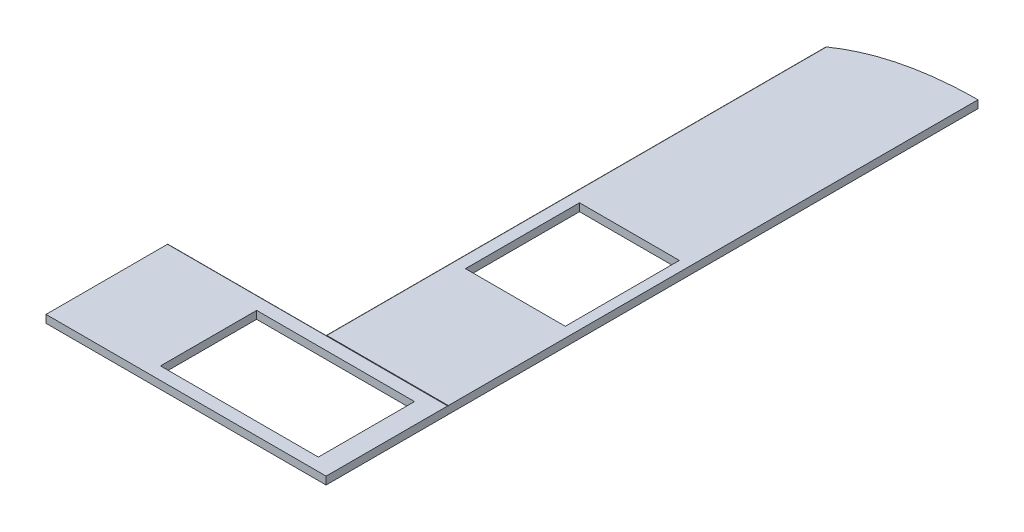
ISO-10303-21;
HEADER;
FILE_DESCRIPTION(('STEP AP214'),'2;1');
FILE_NAME('part.step','',(''),(''),'','','');
FILE_SCHEMA(('AUTOMOTIVE_DESIGN { 1 0 10303 214 1 1 1 1 }'));
ENDSEC;
DATA;
#1=APPLICATION_CONTEXT('core data for automotive mechanical design processes');
#2=APPLICATION_PROTOCOL_DEFINITION('international standard','automotive_design',2000,#1);
#3=PRODUCT_CONTEXT('',#1,'mechanical');
#4=PRODUCT('Part','Part','',(#3));
#5=PRODUCT_RELATED_PRODUCT_CATEGORY('part','',(#4));
#6=PRODUCT_DEFINITION_FORMATION('','',#4);
#7=PRODUCT_DEFINITION_CONTEXT('part definition',#1,'design');
#8=PRODUCT_DEFINITION('design','',#6,#7);
#9=PRODUCT_DEFINITION_SHAPE('','',#8);
#10=(LENGTH_UNIT() NAMED_UNIT(*) SI_UNIT(.MILLI.,.METRE.));
#11=(NAMED_UNIT(*) PLANE_ANGLE_UNIT() SI_UNIT($,.RADIAN.));
#12=(NAMED_UNIT(*) SI_UNIT($,.STERADIAN.) SOLID_ANGLE_UNIT());
#13=UNCERTAINTY_MEASURE_WITH_UNIT(LENGTH_MEASURE(1.E-05),#10,'distance_accuracy_value','');
#14=(GEOMETRIC_REPRESENTATION_CONTEXT(3) GLOBAL_UNCERTAINTY_ASSIGNED_CONTEXT((#13)) GLOBAL_UNIT_ASSIGNED_CONTEXT((#10,
#11,#12)) REPRESENTATION_CONTEXT('',''));
#15=CARTESIAN_POINT('',(0.,0.,0.));
#16=DIRECTION('',(0.,0.,1.));
#17=DIRECTION('',(1.,0.,0.));
#18=AXIS2_PLACEMENT_3D('',#15,#16,#17);
#19=CARTESIAN_POINT('',(1375.,-15.,-300.));
#20=DIRECTION('',(0.,0.,1.));
#21=DIRECTION('',(1.,0.,0.));
#22=AXIS2_PLACEMENT_3D('',#19,#20,#21);
#23=PLANE('',#22);
#24=DIRECTION('',(0.,1.,0.));
#25=VECTOR('',#24,1.);
#26=CARTESIAN_POINT('',(775.,15.,-300.));
#27=LINE('',#26,#25);
#28=CARTESIAN_POINT('',(775.,-15.,-300.));
#29=VERTEX_POINT('',#28);
#30=CARTESIAN_POINT('',(775.,15.,-300.));
#31=VERTEX_POINT('',#30);
#32=EDGE_CURVE('E259',#29,#31,#27,.T.);
#33=ORIENTED_EDGE('',*,*,#32,.F.);
#34=DIRECTION('',(-1.,0.,0.));
#35=VECTOR('',#34,1.);
#36=CARTESIAN_POINT('',(1375.,-15.,-300.));
#37=LINE('',#36,#35);
#38=CARTESIAN_POINT('',(0.,-15.,-300.));
#39=VERTEX_POINT('',#38);
#40=EDGE_CURVE('E237',#29,#39,#37,.T.);
#41=ORIENTED_EDGE('',*,*,#40,.T.);
#42=DIRECTION('',(0.,1.,0.));
#43=VECTOR('',#42,1.);
#44=CARTESIAN_POINT('',(0.,-15.,-300.));
#45=LINE('',#44,#43);
#46=CARTESIAN_POINT('',(0.,15.,-300.));
#47=VERTEX_POINT('',#46);
#48=EDGE_CURVE('E222',#39,#47,#45,.T.);
#49=ORIENTED_EDGE('',*,*,#48,.T.);
#50=DIRECTION('',(-1.,0.,0.));
#51=VECTOR('',#50,1.);
#52=CARTESIAN_POINT('',(1375.,15.,-300.));
#53=LINE('',#52,#51);
#54=EDGE_CURVE('E233',#31,#47,#53,.T.);
#55=ORIENTED_EDGE('',*,*,#54,.F.);
#56=EDGE_LOOP('',(#33,#41,#49,#55));
#57=FACE_BOUND('',#56,.T.);
#58=ADVANCED_FACE('F33',(#57),#23,.F.);
#59=CARTESIAN_POINT('',(1375.,-19.,300.));
#60=DIRECTION('',(0.,0.,-1.));
#61=DIRECTION('',(-1.,0.,0.));
#62=AXIS2_PLACEMENT_3D('',#59,#60,#61);
#63=PLANE('',#62);
#64=DIRECTION('',(0.,-1.,0.));
#65=VECTOR('',#64,1.);
#66=CARTESIAN_POINT('',(0.,-19.,300.));
#67=LINE('',#66,#65);
#68=CARTESIAN_POINT('',(0.,19.,300.));
#69=VERTEX_POINT('',#68);
#70=CARTESIAN_POINT('',(0.,-19.,300.));
#71=VERTEX_POINT('',#70);
#72=EDGE_CURVE('E197',#69,#71,#67,.T.);
#73=ORIENTED_EDGE('',*,*,#72,.T.);
#74=DIRECTION('',(-1.,0.,0.));
#75=VECTOR('',#74,1.);
#76=CARTESIAN_POINT('',(1375.,-19.,300.));
#77=LINE('',#76,#75);
#78=CARTESIAN_POINT('',(1375.,-19.,300.));
#79=VERTEX_POINT('',#78);
#80=EDGE_CURVE('E11',#79,#71,#77,.T.);
#81=ORIENTED_EDGE('',*,*,#80,.F.);
#82=DIRECTION('',(0.,-1.,0.));
#83=VECTOR('',#82,1.);
#84=CARTESIAN_POINT('',(1375.,-19.,300.));
#85=LINE('',#84,#83);
#86=CARTESIAN_POINT('',(1375.,19.,300.));
#87=VERTEX_POINT('',#86);
#88=EDGE_CURVE('E206',#87,#79,#85,.T.);
#89=ORIENTED_EDGE('',*,*,#88,.F.);
#90=DIRECTION('',(-1.,0.,0.));
#91=VECTOR('',#90,1.);
#92=CARTESIAN_POINT('',(1375.,19.,300.));
#93=LINE('',#92,#91);
#94=EDGE_CURVE('E216',#87,#69,#93,.T.);
#95=ORIENTED_EDGE('',*,*,#94,.T.);
#96=EDGE_LOOP('',(#73,#81,#89,#95));
#97=FACE_BOUND('',#96,.T.);
#98=ADVANCED_FACE('F35',(#97),#63,.F.);
#99=CARTESIAN_POINT('',(1375.,-19.,-296.));
#100=DIRECTION('',(0.,1.,0.));
#101=DIRECTION('',(0.,0.,1.));
#102=AXIS2_PLACEMENT_3D('',#99,#100,#101);
#103=PLANE('',#102);
#104=DIRECTION('',(1.,0.,0.));
#105=VECTOR('',#104,1.);
#106=CARTESIAN_POINT('',(1275.,-19.0000000000004,238.));
#107=LINE('',#106,#105);
#108=CARTESIAN_POINT('',(500.,-19.0000000000004,238.));
#109=VERTEX_POINT('',#108);
#110=CARTESIAN_POINT('',(1275.,-19.0000000000004,238.));
#111=VERTEX_POINT('',#110);
#112=EDGE_CURVE('E383',#109,#111,#107,.T.);
#113=ORIENTED_EDGE('',*,*,#112,.T.);
#114=DIRECTION('',(0.,0.,-1.));
#115=VECTOR('',#114,1.);
#116=CARTESIAN_POINT('',(1275.,-19.0000000000004,-234.));
#117=LINE('',#116,#115);
#118=CARTESIAN_POINT('',(1275.,-19.0000000000004,-234.));
#119=VERTEX_POINT('',#118);
#120=EDGE_CURVE('E410',#111,#119,#117,.T.);
#121=ORIENTED_EDGE('',*,*,#120,.T.);
#122=DIRECTION('',(-1.,0.,0.));
#123=VECTOR('',#122,1.);
#124=CARTESIAN_POINT('',(1275.,-19.0000000000004,-234.));
#125=LINE('',#124,#123);
#126=CARTESIAN_POINT('',(500.,-19.,-234.));
#127=VERTEX_POINT('',#126);
#128=EDGE_CURVE('E423',#119,#127,#125,.T.);
#129=ORIENTED_EDGE('',*,*,#128,.T.);
#130=DIRECTION('',(0.,0.,1.));
#131=VECTOR('',#130,1.);
#132=CARTESIAN_POINT('',(500.,-19.0000000000004,-234.));
#133=LINE('',#132,#131);
#134=EDGE_CURVE('E421',#127,#109,#133,.T.);
#135=ORIENTED_EDGE('',*,*,#134,.T.);
#136=EDGE_LOOP('',(#113,#121,#129,#135));
#137=FACE_BOUND('',#136,.T.);
#138=DIRECTION('',(0.,0.,-1.));
#139=VECTOR('',#138,1.);
#140=CARTESIAN_POINT('',(0.,-19.,-296.));
#141=LINE('',#140,#139);
#142=CARTESIAN_POINT('',(0.,-19.,-296.));
#143=VERTEX_POINT('',#142);
#144=EDGE_CURVE('E200',#71,#143,#141,.T.);
#145=ORIENTED_EDGE('',*,*,#144,.T.);
#146=DIRECTION('',(-1.,0.,0.));
#147=VECTOR('',#146,1.);
#148=CARTESIAN_POINT('',(1375.,-19.,-296.));
#149=LINE('',#148,#147);
#150=CARTESIAN_POINT('',(1375.,-19.,-296.));
#151=VERTEX_POINT('',#150);
#152=EDGE_CURVE('E41',#151,#143,#149,.T.);
#153=ORIENTED_EDGE('',*,*,#152,.F.);
#154=DIRECTION('',(0.,0.,-1.));
#155=VECTOR('',#154,1.);
#156=CARTESIAN_POINT('',(1375.,-19.,-296.));
#157=LINE('',#156,#155);
#158=EDGE_CURVE('E208',#79,#151,#157,.T.);
#159=ORIENTED_EDGE('',*,*,#158,.F.);
#160=ORIENTED_EDGE('',*,*,#80,.T.);
#161=EDGE_LOOP('',(#145,#153,#159,#160));
#162=FACE_BOUND('',#161,.T.);
#163=ADVANCED_FACE('F368',(#137,#162),#103,.F.);
#164=CARTESIAN_POINT('',(1375.,-15.,-296.));
#165=DIRECTION('',(-1.,0.,0.));
#166=DIRECTION('',(0.,0.,1.));
#167=AXIS2_PLACEMENT_3D('',#164,#165,#166);
#168=CYLINDRICAL_SURFACE('',#167,4.);
#169=CARTESIAN_POINT('',(0.,-15.,-296.));
#170=DIRECTION('',(1.,0.,0.));
#171=DIRECTION('',(0.,0.,-1.));
#172=AXIS2_PLACEMENT_3D('',#169,#170,#171);
#173=CIRCLE('',#172,4.);
#174=EDGE_CURVE('E219',#143,#39,#173,.T.);
#175=ORIENTED_EDGE('',*,*,#174,.T.);
#176=ORIENTED_EDGE('',*,*,#40,.F.);
#177=CARTESIAN_POINT('',(1375.,-15.,-300.));
#178=VERTEX_POINT('',#177);
#179=EDGE_CURVE('E238',#178,#29,#37,.T.);
#180=ORIENTED_EDGE('',*,*,#179,.F.);
#181=CARTESIAN_POINT('',(1375.,-15.,-296.));
#182=DIRECTION('',(1.,0.,0.));
#183=DIRECTION('',(0.,0.,-1.));
#184=AXIS2_PLACEMENT_3D('',#181,#182,#183);
#185=CIRCLE('',#184,4.);
#186=EDGE_CURVE('E211',#151,#178,#185,.T.);
#187=ORIENTED_EDGE('',*,*,#186,.F.);
#188=ORIENTED_EDGE('',*,*,#152,.T.);
#189=EDGE_LOOP('',(#175,#176,#180,#187,#188));
#190=FACE_BOUND('',#189,.T.);
#191=ADVANCED_FACE('F245',(#190),#168,.T.);
#192=CARTESIAN_POINT('',(1375.,15.,-296.));
#193=DIRECTION('',(-1.,0.,0.));
#194=DIRECTION('',(0.,0.,1.));
#195=AXIS2_PLACEMENT_3D('',#192,#193,#194);
#196=CYLINDRICAL_SURFACE('',#195,4.);
#197=CARTESIAN_POINT('',(0.,15.,-296.));
#198=DIRECTION('',(1.,0.,0.));
#199=DIRECTION('',(0.,0.,-1.));
#200=AXIS2_PLACEMENT_3D('',#197,#198,#199);
#201=CIRCLE('',#200,4.);
#202=CARTESIAN_POINT('',(0.,19.,-296.));
#203=VERTEX_POINT('',#202);
#204=EDGE_CURVE('E225',#47,#203,#201,.T.);
#205=ORIENTED_EDGE('',*,*,#204,.T.);
#206=DIRECTION('',(-1.,0.,0.));
#207=VECTOR('',#206,1.);
#208=CARTESIAN_POINT('',(1375.,19.,-296.));
#209=LINE('',#208,#207);
#210=CARTESIAN_POINT('',(1375.,19.,-296.));
#211=VERTEX_POINT('',#210);
#212=EDGE_CURVE('E230',#211,#203,#209,.T.);
#213=ORIENTED_EDGE('',*,*,#212,.F.);
#214=CARTESIAN_POINT('',(1375.,15.,-296.));
#215=DIRECTION('',(1.,0.,0.));
#216=DIRECTION('',(0.,0.,-1.));
#217=AXIS2_PLACEMENT_3D('',#214,#215,#216);
#218=CIRCLE('',#217,4.);
#219=CARTESIAN_POINT('',(1375.,15.,-300.));
#220=VERTEX_POINT('',#219);
#221=EDGE_CURVE('E213',#220,#211,#218,.T.);
#222=ORIENTED_EDGE('',*,*,#221,.F.);
#223=EDGE_CURVE('E234',#220,#31,#53,.T.);
#224=ORIENTED_EDGE('',*,*,#223,.T.);
#225=ORIENTED_EDGE('',*,*,#54,.T.);
#226=EDGE_LOOP('',(#205,#213,#222,#224,#225));
#227=FACE_BOUND('',#226,.T.);
#228=ADVANCED_FACE('F372',(#227),#196,.T.);
#229=CARTESIAN_POINT('',(1375.,19.,-296.));
#230=DIRECTION('',(0.,-1.,0.));
#231=DIRECTION('',(0.,0.,-1.));
#232=AXIS2_PLACEMENT_3D('',#229,#230,#231);
#233=PLANE('',#232);
#234=DIRECTION('',(-1.,0.,0.));
#235=VECTOR('',#234,1.);
#236=CARTESIAN_POINT('',(1275.,19.,-234.));
#237=LINE('',#236,#235);
#238=CARTESIAN_POINT('',(1275.,19.,-234.));
#239=VERTEX_POINT('',#238);
#240=CARTESIAN_POINT('',(500.,19.,-234.));
#241=VERTEX_POINT('',#240);
#242=EDGE_CURVE('E414',#239,#241,#237,.T.);
#243=ORIENTED_EDGE('',*,*,#242,.F.);
#244=DIRECTION('',(0.,0.,-1.));
#245=VECTOR('',#244,1.);
#246=CARTESIAN_POINT('',(1275.,19.,-234.));
#247=LINE('',#246,#245);
#248=CARTESIAN_POINT('',(1275.,19.,238.));
#249=VERTEX_POINT('',#248);
#250=EDGE_CURVE('E417',#249,#239,#247,.T.);
#251=ORIENTED_EDGE('',*,*,#250,.F.);
#252=DIRECTION('',(1.,0.,0.));
#253=VECTOR('',#252,1.);
#254=CARTESIAN_POINT('',(1275.,19.,238.));
#255=LINE('',#254,#253);
#256=CARTESIAN_POINT('',(500.,19.,238.));
#257=VERTEX_POINT('',#256);
#258=EDGE_CURVE('E407',#257,#249,#255,.T.);
#259=ORIENTED_EDGE('',*,*,#258,.F.);
#260=DIRECTION('',(0.,0.,1.));
#261=VECTOR('',#260,1.);
#262=CARTESIAN_POINT('',(500.,19.,-234.));
#263=LINE('',#262,#261);
#264=EDGE_CURVE('E411',#241,#257,#263,.T.);
#265=ORIENTED_EDGE('',*,*,#264,.F.);
#266=EDGE_LOOP('',(#243,#251,#259,#265));
#267=FACE_BOUND('',#266,.T.);
#268=DIRECTION('',(0.,0.,1.));
#269=VECTOR('',#268,1.);
#270=CARTESIAN_POINT('',(0.,19.,-296.));
#271=LINE('',#270,#269);
#272=EDGE_CURVE('E209',#203,#69,#271,.T.);
#273=ORIENTED_EDGE('',*,*,#272,.T.);
#274=ORIENTED_EDGE('',*,*,#94,.F.);
#275=DIRECTION('',(0.,0.,1.));
#276=VECTOR('',#275,1.);
#277=CARTESIAN_POINT('',(1375.,19.,-296.));
#278=LINE('',#277,#276);
#279=EDGE_CURVE('E215',#211,#87,#278,.T.);
#280=ORIENTED_EDGE('',*,*,#279,.F.);
#281=ORIENTED_EDGE('',*,*,#212,.T.);
#282=EDGE_LOOP('',(#273,#274,#280,#281));
#283=FACE_BOUND('',#282,.T.);
#284=ADVANCED_FACE('F388',(#267,#283),#233,.F.);
#285=CARTESIAN_POINT('',(1375.,15.,-296.));
#286=DIRECTION('',(1.,0.,0.));
#287=DIRECTION('',(0.,0.,-1.));
#288=AXIS2_PLACEMENT_3D('',#285,#286,#287);
#289=PLANE('',#288);
#290=ORIENTED_EDGE('',*,*,#88,.T.);
#291=ORIENTED_EDGE('',*,*,#158,.T.);
#292=ORIENTED_EDGE('',*,*,#186,.T.);
#293=DIRECTION('',(0.,-1.,0.));
#294=VECTOR('',#293,1.);
#295=CARTESIAN_POINT('',(1375.,19.,-300.));
#296=LINE('',#295,#294);
#297=CARTESIAN_POINT('',(1375.,-19.,-300.));
#298=VERTEX_POINT('',#297);
#299=EDGE_CURVE('E195',#178,#298,#296,.T.);
#300=ORIENTED_EDGE('',*,*,#299,.T.);
#301=DIRECTION('',(0.,0.,1.));
#302=VECTOR('',#301,1.);
#303=CARTESIAN_POINT('',(1375.,-19.,-2900.));
#304=LINE('',#303,#302);
#305=CARTESIAN_POINT('',(1375.,-19.0000000000004,-2900.));
#306=VERTEX_POINT('',#305);
#307=EDGE_CURVE('E188',#306,#298,#304,.T.);
#308=ORIENTED_EDGE('',*,*,#307,.F.);
#309=DIRECTION('',(0.,-1.,0.));
#310=VECTOR('',#309,1.);
#311=CARTESIAN_POINT('',(1375.,19.,-2900.));
#312=LINE('',#311,#310);
#313=CARTESIAN_POINT('',(1375.,19.,-2900.));
#314=VERTEX_POINT('',#313);
#315=EDGE_CURVE('E169',#314,#306,#312,.T.);
#316=ORIENTED_EDGE('',*,*,#315,.F.);
#317=DIRECTION('',(0.,0.,1.));
#318=VECTOR('',#317,1.);
#319=CARTESIAN_POINT('',(1375.,19.,-2900.));
#320=LINE('',#319,#318);
#321=CARTESIAN_POINT('',(1375.,19.,-300.));
#322=VERTEX_POINT('',#321);
#323=EDGE_CURVE('E180',#314,#322,#320,.T.);
#324=ORIENTED_EDGE('',*,*,#323,.T.);
#325=EDGE_CURVE('E272',#322,#220,#296,.T.);
#326=ORIENTED_EDGE('',*,*,#325,.T.);
#327=ORIENTED_EDGE('',*,*,#221,.T.);
#328=ORIENTED_EDGE('',*,*,#279,.T.);
#329=EDGE_LOOP('',(#290,#291,#292,#300,#308,#316,#324,#326,#327,#328));
#330=FACE_BOUND('',#329,.T.);
#331=ADVANCED_FACE('F193',(#330),#289,.T.);
#332=CARTESIAN_POINT('',(0.,15.,-296.));
#333=DIRECTION('',(1.,0.,0.));
#334=DIRECTION('',(0.,0.,-1.));
#335=AXIS2_PLACEMENT_3D('',#332,#333,#334);
#336=PLANE('',#335);
#337=ORIENTED_EDGE('',*,*,#72,.F.);
#338=ORIENTED_EDGE('',*,*,#272,.F.);
#339=ORIENTED_EDGE('',*,*,#204,.F.);
#340=ORIENTED_EDGE('',*,*,#48,.F.);
#341=ORIENTED_EDGE('',*,*,#174,.F.);
#342=ORIENTED_EDGE('',*,*,#144,.F.);
#343=EDGE_LOOP('',(#337,#338,#339,#340,#341,#342));
#344=FACE_BOUND('',#343,.T.);
#345=ADVANCED_FACE('F252',(#344),#336,.F.);
#346=CARTESIAN_POINT('',(779.,-15.,-300.));
#347=DIRECTION('',(0.,0.,-1.));
#348=DIRECTION('',(-1.,0.,0.));
#349=AXIS2_PLACEMENT_3D('',#346,#347,#348);
#350=PLANE('',#349);
#351=ORIENTED_EDGE('',*,*,#299,.F.);
#352=ORIENTED_EDGE('',*,*,#179,.T.);
#353=CARTESIAN_POINT('',(779.,-15.,-300.));
#354=DIRECTION('',(0.,0.,-1.));
#355=DIRECTION('',(-1.,0.,0.));
#356=AXIS2_PLACEMENT_3D('',#353,#354,#355);
#357=CIRCLE('',#356,4.);
#358=CARTESIAN_POINT('',(779.,-19.,-300.));
#359=VERTEX_POINT('',#358);
#360=EDGE_CURVE('E264',#359,#29,#357,.T.);
#361=ORIENTED_EDGE('',*,*,#360,.F.);
#362=DIRECTION('',(-1.,0.,0.));
#363=VECTOR('',#362,1.);
#364=CARTESIAN_POINT('',(1375.,-19.,-300.));
#365=LINE('',#364,#363);
#366=EDGE_CURVE('E268',#298,#359,#365,.T.);
#367=ORIENTED_EDGE('',*,*,#366,.F.);
#368=EDGE_LOOP('',(#351,#352,#361,#367));
#369=FACE_BOUND('',#368,.T.);
#370=ADVANCED_FACE('F263',(#369),#350,.F.);
#371=CARTESIAN_POINT('',(1375.,-19.,-2900.));
#372=DIRECTION('',(0.,1.,0.));
#373=DIRECTION('',(0.,0.,1.));
#374=AXIS2_PLACEMENT_3D('',#371,#372,#373);
#375=PLANE('',#374);
#376=DIRECTION('',(1.,0.,0.));
#377=VECTOR('',#376,1.);
#378=CARTESIAN_POINT('',(835.,-19.0000000000004,-924.));
#379=LINE('',#378,#377);
#380=CARTESIAN_POINT('',(835.,-19.0000000000004,-924.));
#381=VERTEX_POINT('',#380);
#382=CARTESIAN_POINT('',(1325.,-19.0000000000004,-924.));
#383=VERTEX_POINT('',#382);
#384=EDGE_CURVE('E430',#381,#383,#379,.T.);
#385=ORIENTED_EDGE('',*,*,#384,.T.);
#386=DIRECTION('',(0.,0.,-1.));
#387=VECTOR('',#386,1.);
#388=CARTESIAN_POINT('',(1325.,-19.0000000000004,-924.));
#389=LINE('',#388,#387);
#390=CARTESIAN_POINT('',(1325.,-19.0000000000004,-1484.));
#391=VERTEX_POINT('',#390);
#392=EDGE_CURVE('E438',#383,#391,#389,.T.);
#393=ORIENTED_EDGE('',*,*,#392,.T.);
#394=DIRECTION('',(-1.,0.,0.));
#395=VECTOR('',#394,1.);
#396=CARTESIAN_POINT('',(835.,-19.0000000000004,-1484.));
#397=LINE('',#396,#395);
#398=CARTESIAN_POINT('',(835.,-19.,-1484.));
#399=VERTEX_POINT('',#398);
#400=EDGE_CURVE('E449',#391,#399,#397,.T.);
#401=ORIENTED_EDGE('',*,*,#400,.T.);
#402=DIRECTION('',(0.,0.,1.));
#403=VECTOR('',#402,1.);
#404=CARTESIAN_POINT('',(835.,-19.0000000000004,-924.));
#405=LINE('',#404,#403);
#406=EDGE_CURVE('E48',#399,#381,#405,.T.);
#407=ORIENTED_EDGE('',*,*,#406,.T.);
#408=EDGE_LOOP('',(#385,#393,#401,#407));
#409=FACE_BOUND('',#408,.T.);
#410=DIRECTION('',(0.,0.,1.));
#411=VECTOR('',#410,1.);
#412=CARTESIAN_POINT('',(779.,-19.,-2900.));
#413=LINE('',#412,#411);
#414=CARTESIAN_POINT('',(779.000000000003,-19.0000000000004,-2752.82345211521));
#415=VERTEX_POINT('',#414);
#416=EDGE_CURVE('E189',#415,#359,#413,.T.);
#417=ORIENTED_EDGE('',*,*,#416,.F.);
#418=CARTESIAN_POINT('',(775.,-19.0000000000004,-2750.));
#419=CARTESIAN_POINT('',(983.393090416953,-19.0000000000004,-2898.41660785058));
#420=CARTESIAN_POINT('',(1375.,-19.0000000000004,-2900.));
#421=B_SPLINE_CURVE_WITH_KNOTS('',2,(#418,#419,#420),.UNSPECIFIED.,.F.,.F.,(3,3),(0.,1.),.UNSPECIFIED.);
#422=EDGE_CURVE('E172',#415,#306,#421,.T.);
#423=ORIENTED_EDGE('',*,*,#422,.T.);
#424=ORIENTED_EDGE('',*,*,#307,.T.);
#425=ORIENTED_EDGE('',*,*,#366,.T.);
#426=EDGE_LOOP('',(#417,#423,#424,#425));
#427=FACE_BOUND('',#426,.T.);
#428=ADVANCED_FACE('F186',(#409,#427),#375,.F.);
#429=CARTESIAN_POINT('',(779.,-15.,-2900.));
#430=DIRECTION('',(0.,0.,1.));
#431=DIRECTION('',(1.,0.,0.));
#432=AXIS2_PLACEMENT_3D('',#429,#430,#431);
#433=CYLINDRICAL_SURFACE('',#432,4.);
#434=DIRECTION('',(0.,0.,1.));
#435=VECTOR('',#434,1.);
#436=CARTESIAN_POINT('',(775.,-15.,-2900.));
#437=LINE('',#436,#435);
#438=CARTESIAN_POINT('',(775.,-15.,-2750.));
#439=VERTEX_POINT('',#438);
#440=EDGE_CURVE('E202',#439,#29,#437,.T.);
#441=ORIENTED_EDGE('',*,*,#440,.F.);
#442=CARTESIAN_POINT('',(775.,-15.,-2750.));
#443=CARTESIAN_POINT('',(774.999979877533,-15.0977896592813,-2749.99998541423));
#444=CARTESIAN_POINT('',(775.003585156807,-15.195569471886,-2750.00255332583));
#445=CARTESIAN_POINT('',(775.017896300316,-15.3902990314293,-2750.01274530157));
#446=CARTESIAN_POINT('',(775.02859889183,-15.4872491401005,-2750.02036703528));
#447=CARTESIAN_POINT('',(775.056876381708,-15.6790692156135,-2750.04050223327));
#448=CARTESIAN_POINT('',(775.074412993558,-15.7739477143784,-2750.05298844498));
#449=CARTESIAN_POINT('',(775.116090152642,-15.9614942726811,-2750.08265806367));
#450=CARTESIAN_POINT('',(775.140231161588,-16.0541621771843,-2750.09984179905));
#451=CARTESIAN_POINT('',(775.194731542074,-16.2365152946048,-2750.13862758149));
#452=CARTESIAN_POINT('',(775.225079900518,-16.3262054674816,-2750.16022180335));
#453=CARTESIAN_POINT('',(775.29162489079,-16.5022734221981,-2750.20755999604));
#454=CARTESIAN_POINT('',(775.327823776836,-16.5886499113329,-2750.23330556637));
#455=CARTESIAN_POINT('',(775.444621450742,-16.8422483833437,-2750.31635171929));
#456=CARTESIAN_POINT('',(775.533410130503,-17.0039028600607,-2750.37945382298));
#457=CARTESIAN_POINT('',(775.735715190371,-17.3199247395958,-2750.5231275179));
#458=CARTESIAN_POINT('',(775.850497475558,-17.4730606869436,-2750.604591724));
#459=CARTESIAN_POINT('',(776.096594113057,-17.757837875557,-2750.77909804911));
#460=CARTESIAN_POINT('',(776.227912563648,-17.8894737696639,-2750.87214303822));
#461=CARTESIAN_POINT('',(776.52787378822,-18.1519890554947,-2751.08447149695));
#462=CARTESIAN_POINT('',(776.699009580176,-18.2786140868253,-2751.20548467458));
#463=CARTESIAN_POINT('',(777.054323116433,-18.5011954192325,-2751.45642116752));
#464=CARTESIAN_POINT('',(777.238515123026,-18.5971175303592,-2751.58635422165));
#465=CARTESIAN_POINT('',(777.650306357432,-18.7732271531907,-2751.87646296954));
#466=CARTESIAN_POINT('',(777.87967916704,-18.8473196510077,-2752.03782063237));
#467=CARTESIAN_POINT('',(778.344781885959,-18.9531586444466,-2752.36448749494));
#468=CARTESIAN_POINT('',(778.580502015225,-18.9849668657346,-2752.52979057535));
#469=CARTESIAN_POINT('',(778.877824517024,-18.9986008506908,-2752.73796288557));
#470=CARTESIAN_POINT('',(778.938918163252,-18.9999999448956,-2752.78072050217));
#471=CARTESIAN_POINT('',(779.,-19.,-2752.82345211521));
#472=B_SPLINE_CURVE_WITH_KNOTS('',3,(#442,#443,#444,#445,#446,#447,#448,#449,#450,#451,#452,
#453,#454,#455,#456,#457,#458,#459,#460,#461,#462,#463,#464,#465,#466,#467,#468,#469,#470,#471),
.UNSPECIFIED.,.F.,.F.,(4,2,2,2,2,2,2,2,2,2,2,2,2,2,4),(0.,0.293253389905308,0.586371648415019,
0.87787083461123,1.16939040463113,1.46039717779363,1.75151634484239,2.33387028452236,
2.95559389054226,3.57747188730174,4.30937551036755,5.04209134886918,5.90894096908045,
6.77452378643034,6.99821345336306),.UNSPECIFIED.);
#473=EDGE_CURVE('E291',#439,#415,#472,.T.);
#474=ORIENTED_EDGE('',*,*,#473,.T.);
#475=ORIENTED_EDGE('',*,*,#416,.T.);
#476=ORIENTED_EDGE('',*,*,#360,.T.);
#477=EDGE_LOOP('',(#441,#474,#475,#476));
#478=FACE_BOUND('',#477,.T.);
#479=ADVANCED_FACE('F267',(#478),#433,.T.);
#480=CARTESIAN_POINT('',(775.,15.,-2900.));
#481=DIRECTION('',(1.,0.,0.));
#482=DIRECTION('',(0.,0.,-1.));
#483=AXIS2_PLACEMENT_3D('',#480,#481,#482);
#484=PLANE('',#483);
#485=DIRECTION('',(0.,0.,1.));
#486=VECTOR('',#485,1.);
#487=CARTESIAN_POINT('',(775.,15.,-2900.));
#488=LINE('',#487,#486);
#489=CARTESIAN_POINT('',(775.,15.,-2750.));
#490=VERTEX_POINT('',#489);
#491=EDGE_CURVE('E282',#490,#31,#488,.T.);
#492=ORIENTED_EDGE('',*,*,#491,.F.);
#493=DIRECTION('',(0.,1.,0.));
#494=VECTOR('',#493,1.);
#495=CARTESIAN_POINT('',(775.,-19.0000000000004,-2750.));
#496=LINE('',#495,#494);
#497=EDGE_CURVE('E190',#439,#490,#496,.T.);
#498=ORIENTED_EDGE('',*,*,#497,.F.);
#499=ORIENTED_EDGE('',*,*,#440,.T.);
#500=ORIENTED_EDGE('',*,*,#32,.T.);
#501=EDGE_LOOP('',(#492,#498,#499,#500));
#502=FACE_BOUND('',#501,.T.);
#503=ADVANCED_FACE('F286',(#502),#484,.F.);
#504=CARTESIAN_POINT('',(779.,15.,-2900.));
#505=DIRECTION('',(0.,0.,1.));
#506=DIRECTION('',(1.,0.,0.));
#507=AXIS2_PLACEMENT_3D('',#504,#505,#506);
#508=CYLINDRICAL_SURFACE('',#507,4.);
#509=DIRECTION('',(0.,0.,1.));
#510=VECTOR('',#509,1.);
#511=CARTESIAN_POINT('',(779.,19.,-2900.));
#512=LINE('',#511,#510);
#513=CARTESIAN_POINT('',(779.000000000004,19.,-2752.82345211521));
#514=VERTEX_POINT('',#513);
#515=CARTESIAN_POINT('',(779.,19.,-300.));
#516=VERTEX_POINT('',#515);
#517=EDGE_CURVE('E280',#514,#516,#512,.T.);
#518=ORIENTED_EDGE('',*,*,#517,.F.);
#519=CARTESIAN_POINT('',(779.,19.,-2752.82345211521));
#520=CARTESIAN_POINT('',(778.861386894271,18.9999913473369,-2752.72648163509));
#521=CARTESIAN_POINT('',(778.722808137929,18.9927941827911,-2752.62944358639));
#522=CARTESIAN_POINT('',(778.446670579474,18.9639786822407,-2752.435904357));
#523=CARTESIAN_POINT('',(778.309112363553,18.9423526224835,-2752.33940349177));
#524=CARTESIAN_POINT('',(778.034768005762,18.8843497202456,-2752.14676826633));
#525=CARTESIAN_POINT('',(777.898002951841,18.8478291189761,-2752.05064696804));
#526=CARTESIAN_POINT('',(777.627795457625,18.759951535708,-2751.86056938362));
#527=CARTESIAN_POINT('',(777.494352409423,18.7085972901794,-2751.76661270163));
#528=CARTESIAN_POINT('',(777.236765685375,18.5930763812076,-2751.58508978684));
#529=CARTESIAN_POINT('',(777.112460261187,18.5294417122522,-2751.49741536678));
#530=CARTESIAN_POINT('',(776.869333430933,18.388218157036,-2751.32579734201));
#531=CARTESIAN_POINT('',(776.750511001145,18.3106318890101,-2751.24185304097));
#532=CARTESIAN_POINT('',(776.520226425103,18.1418153991001,-2751.07904146552));
#533=CARTESIAN_POINT('',(776.408734859598,18.0506452064179,-2751.00015393466));
#534=CARTESIAN_POINT('',(776.194241148692,17.8546178705334,-2750.84828019699));
#535=CARTESIAN_POINT('',(776.09123444239,17.7497681598994,-2750.77529082013));
#536=CARTESIAN_POINT('',(775.862168898731,17.4886612433585,-2750.61287541276));
#537=CARTESIAN_POINT('',(775.740104200797,17.3270142297119,-2750.52624500905));
#538=CARTESIAN_POINT('',(775.574478445123,17.0679366308166,-2750.40861960674));
#539=CARTESIAN_POINT('',(775.52215375828,16.9787469495488,-2750.37144459534));
#540=CARTESIAN_POINT('',(775.423958286089,16.7951985624264,-2750.30165829128));
#541=CARTESIAN_POINT('',(775.378084346084,16.700842414756,-2750.26904476794));
#542=CARTESIAN_POINT('',(775.293054536146,16.5066169564148,-2750.20857799699));
#543=CARTESIAN_POINT('',(775.253960523212,16.4067068551959,-2750.18076858806));
#544=CARTESIAN_POINT('',(775.183621001506,16.2028576319471,-2750.13072220671));
#545=CARTESIAN_POINT('',(775.15237136817,16.0989206605666,-2750.10848230586));
#546=CARTESIAN_POINT('',(775.098299953564,15.8880129251484,-2750.06999452185));
#547=CARTESIAN_POINT('',(775.07546193913,15.7810484381529,-2750.05373509734));
#548=CARTESIAN_POINT('',(775.038577271801,15.5649168112898,-2750.02747272869));
#549=CARTESIAN_POINT('',(775.024523944494,15.4557514088873,-2750.01746503461));
#550=CARTESIAN_POINT('',(775.01000160443,15.2885298016564,-2750.00712297273));
#551=CARTESIAN_POINT('',(775.006250613449,15.2308776211893,-2750.00445161116));
#552=CARTESIAN_POINT('',(775.001250926575,15.1154868848374,-2750.00089090649));
#553=CARTESIAN_POINT('',(774.999998912002,15.0577485455496,-2749.99999919997));
#554=CARTESIAN_POINT('',(775.,15.,-2750.));
#555=B_SPLINE_CURVE_WITH_KNOTS('',3,(#519,#520,#521,#522,#523,#524,#525,#526,#527,#528,#529,
#530,#531,#532,#533,#534,#535,#536,#537,#538,#539,#540,#541,#542,#543,#544,#545,#546,#547,#548,
#549,#550,#551,#552,#553,#554),.UNSPECIFIED.,.F.,.F.,(4,2,2,2,2,2,2,2,2,2,2,2,2,2,2,2,2,4),(0.,
0.50736035767709,1.01499252225294,1.527644773335,2.04020251206886,2.53417812181501,
3.02806112590423,3.51982299966298,4.01131878586093,4.66912845559464,4.99845662878554,
5.32762318384537,5.65965075462606,5.99150337838955,6.32271217839963,6.65366902641709,
6.82710456388817,7.00030962264207),.UNSPECIFIED.);
#556=EDGE_CURVE('E289',#514,#490,#555,.T.);
#557=ORIENTED_EDGE('',*,*,#556,.T.);
#558=ORIENTED_EDGE('',*,*,#491,.T.);
#559=CARTESIAN_POINT('',(779.,15.,-300.));
#560=DIRECTION('',(0.,0.,-1.));
#561=DIRECTION('',(1.,0.,0.));
#562=AXIS2_PLACEMENT_3D('',#559,#560,#561);
#563=CIRCLE('',#562,4.);
#564=EDGE_CURVE('E270',#31,#516,#563,.T.);
#565=ORIENTED_EDGE('',*,*,#564,.T.);
#566=EDGE_LOOP('',(#518,#557,#558,#565));
#567=FACE_BOUND('',#566,.T.);
#568=ADVANCED_FACE('F307',(#567),#508,.T.);
#569=CARTESIAN_POINT('',(1375.,19.,-2900.));
#570=DIRECTION('',(0.,-1.,0.));
#571=DIRECTION('',(0.,0.,-1.));
#572=AXIS2_PLACEMENT_3D('',#569,#570,#571);
#573=PLANE('',#572);
#574=DIRECTION('',(-1.,0.,0.));
#575=VECTOR('',#574,1.);
#576=CARTESIAN_POINT('',(835.,19.,-1484.));
#577=LINE('',#576,#575);
#578=CARTESIAN_POINT('',(1325.,19.,-1484.));
#579=VERTEX_POINT('',#578);
#580=CARTESIAN_POINT('',(835.,19.,-1484.));
#581=VERTEX_POINT('',#580);
#582=EDGE_CURVE('E442',#579,#581,#577,.T.);
#583=ORIENTED_EDGE('',*,*,#582,.F.);
#584=DIRECTION('',(0.,0.,-1.));
#585=VECTOR('',#584,1.);
#586=CARTESIAN_POINT('',(1325.,19.,-924.));
#587=LINE('',#586,#585);
#588=CARTESIAN_POINT('',(1325.,19.,-924.));
#589=VERTEX_POINT('',#588);
#590=EDGE_CURVE('E56',#589,#579,#587,.T.);
#591=ORIENTED_EDGE('',*,*,#590,.F.);
#592=DIRECTION('',(1.,0.,0.));
#593=VECTOR('',#592,1.);
#594=CARTESIAN_POINT('',(835.,19.,-924.));
#595=LINE('',#594,#593);
#596=CARTESIAN_POINT('',(835.,19.,-924.));
#597=VERTEX_POINT('',#596);
#598=EDGE_CURVE('E435',#597,#589,#595,.T.);
#599=ORIENTED_EDGE('',*,*,#598,.F.);
#600=DIRECTION('',(0.,0.,1.));
#601=VECTOR('',#600,1.);
#602=CARTESIAN_POINT('',(835.,19.,-924.));
#603=LINE('',#602,#601);
#604=EDGE_CURVE('E439',#581,#597,#603,.T.);
#605=ORIENTED_EDGE('',*,*,#604,.F.);
#606=EDGE_LOOP('',(#583,#591,#599,#605));
#607=FACE_BOUND('',#606,.T.);
#608=ORIENTED_EDGE('',*,*,#323,.F.);
#609=CARTESIAN_POINT('',(775.,19.,-2750.));
#610=CARTESIAN_POINT('',(983.393090416953,19.,-2898.41660785058));
#611=CARTESIAN_POINT('',(1375.,19.,-2900.));
#612=B_SPLINE_CURVE_WITH_KNOTS('',2,(#609,#610,#611),.UNSPECIFIED.,.F.,.F.,(3,3),(0.,1.),.UNSPECIFIED.);
#613=EDGE_CURVE('E175',#514,#314,#612,.T.);
#614=ORIENTED_EDGE('',*,*,#613,.F.);
#615=ORIENTED_EDGE('',*,*,#517,.T.);
#616=DIRECTION('',(1.,0.,0.));
#617=VECTOR('',#616,1.);
#618=CARTESIAN_POINT('',(1375.,19.,-300.));
#619=LINE('',#618,#617);
#620=EDGE_CURVE('E181',#516,#322,#619,.T.);
#621=ORIENTED_EDGE('',*,*,#620,.T.);
#622=EDGE_LOOP('',(#608,#614,#615,#621));
#623=FACE_BOUND('',#622,.T.);
#624=ADVANCED_FACE('F353',(#607,#623),#573,.F.);
#625=ORIENTED_EDGE('',*,*,#223,.F.);
#626=ORIENTED_EDGE('',*,*,#325,.F.);
#627=ORIENTED_EDGE('',*,*,#620,.F.);
#628=ORIENTED_EDGE('',*,*,#564,.F.);
#629=EDGE_LOOP('',(#625,#626,#627,#628));
#630=FACE_BOUND('',#629,.T.);
#631=ADVANCED_FACE('F350',(#630),#350,.F.);
#632=CARTESIAN_POINT('',(1275.,-19.0000000000004,-234.));
#633=DIRECTION('',(1.,0.,0.));
#634=DIRECTION('',(0.,0.,-1.));
#635=AXIS2_PLACEMENT_3D('',#632,#633,#634);
#636=PLANE('',#635);
#637=ORIENTED_EDGE('',*,*,#250,.T.);
#638=DIRECTION('',(0.,1.,0.));
#639=VECTOR('',#638,1.);
#640=CARTESIAN_POINT('',(1275.,-19.0000000000004,-234.));
#641=LINE('',#640,#639);
#642=EDGE_CURVE('E399',#119,#239,#641,.T.);
#643=ORIENTED_EDGE('',*,*,#642,.F.);
#644=ORIENTED_EDGE('',*,*,#120,.F.);
#645=DIRECTION('',(0.,1.,0.));
#646=VECTOR('',#645,1.);
#647=CARTESIAN_POINT('',(1275.,-19.0000000000004,238.));
#648=LINE('',#647,#646);
#649=EDGE_CURVE('E397',#111,#249,#648,.T.);
#650=ORIENTED_EDGE('',*,*,#649,.T.);
#651=EDGE_LOOP('',(#637,#643,#644,#650));
#652=FACE_BOUND('',#651,.T.);
#653=ADVANCED_FACE('F340',(#652),#636,.F.);
#654=CARTESIAN_POINT('',(1275.,-19.0000000000004,238.));
#655=DIRECTION('',(0.,0.,1.));
#656=DIRECTION('',(0.,-1.,0.));
#657=AXIS2_PLACEMENT_3D('',#654,#655,#656);
#658=PLANE('',#657);
#659=ORIENTED_EDGE('',*,*,#258,.T.);
#660=ORIENTED_EDGE('',*,*,#649,.F.);
#661=ORIENTED_EDGE('',*,*,#112,.F.);
#662=DIRECTION('',(0.,1.,0.));
#663=VECTOR('',#662,1.);
#664=CARTESIAN_POINT('',(500.,-19.0000000000004,238.));
#665=LINE('',#664,#663);
#666=EDGE_CURVE('E404',#109,#257,#665,.T.);
#667=ORIENTED_EDGE('',*,*,#666,.T.);
#668=EDGE_LOOP('',(#659,#660,#661,#667));
#669=FACE_BOUND('',#668,.T.);
#670=ADVANCED_FACE('F336',(#669),#658,.F.);
#671=CARTESIAN_POINT('',(500.,-19.0000000000004,-234.));
#672=DIRECTION('',(-1.,0.,0.));
#673=DIRECTION('',(0.,0.,1.));
#674=AXIS2_PLACEMENT_3D('',#671,#672,#673);
#675=PLANE('',#674);
#676=ORIENTED_EDGE('',*,*,#264,.T.);
#677=ORIENTED_EDGE('',*,*,#666,.F.);
#678=ORIENTED_EDGE('',*,*,#134,.F.);
#679=DIRECTION('',(0.,1.,0.));
#680=VECTOR('',#679,1.);
#681=CARTESIAN_POINT('',(500.,-19.0000000000004,-234.));
#682=LINE('',#681,#680);
#683=EDGE_CURVE('E402',#127,#241,#682,.T.);
#684=ORIENTED_EDGE('',*,*,#683,.T.);
#685=EDGE_LOOP('',(#676,#677,#678,#684));
#686=FACE_BOUND('',#685,.T.);
#687=ADVANCED_FACE('F339',(#686),#675,.F.);
#688=CARTESIAN_POINT('',(1275.,-19.0000000000004,-234.));
#689=DIRECTION('',(0.,0.,-1.));
#690=DIRECTION('',(0.,1.,0.));
#691=AXIS2_PLACEMENT_3D('',#688,#689,#690);
#692=PLANE('',#691);
#693=ORIENTED_EDGE('',*,*,#242,.T.);
#694=ORIENTED_EDGE('',*,*,#683,.F.);
#695=ORIENTED_EDGE('',*,*,#128,.F.);
#696=ORIENTED_EDGE('',*,*,#642,.T.);
#697=EDGE_LOOP('',(#693,#694,#695,#696));
#698=FACE_BOUND('',#697,.T.);
#699=ADVANCED_FACE('F335',(#698),#692,.F.);
#700=CARTESIAN_POINT('',(1325.,-19.0000000000004,-924.));
#701=DIRECTION('',(1.,0.,0.));
#702=DIRECTION('',(0.,0.,-1.));
#703=AXIS2_PLACEMENT_3D('',#700,#701,#702);
#704=PLANE('',#703);
#705=ORIENTED_EDGE('',*,*,#590,.T.);
#706=DIRECTION('',(0.,1.,0.));
#707=VECTOR('',#706,1.);
#708=CARTESIAN_POINT('',(1325.,-19.0000000000004,-1484.));
#709=LINE('',#708,#707);
#710=EDGE_CURVE('E427',#391,#579,#709,.T.);
#711=ORIENTED_EDGE('',*,*,#710,.F.);
#712=ORIENTED_EDGE('',*,*,#392,.F.);
#713=DIRECTION('',(0.,1.,0.));
#714=VECTOR('',#713,1.);
#715=CARTESIAN_POINT('',(1325.,-19.0000000000004,-924.));
#716=LINE('',#715,#714);
#717=EDGE_CURVE('E419',#383,#589,#716,.T.);
#718=ORIENTED_EDGE('',*,*,#717,.T.);
#719=EDGE_LOOP('',(#705,#711,#712,#718));
#720=FACE_BOUND('',#719,.T.);
#721=ADVANCED_FACE('F326',(#720),#704,.F.);
#722=CARTESIAN_POINT('',(835.,-19.0000000000004,-924.));
#723=DIRECTION('',(0.,0.,1.));
#724=DIRECTION('',(1.,0.,0.));
#725=AXIS2_PLACEMENT_3D('',#722,#723,#724);
#726=PLANE('',#725);
#727=ORIENTED_EDGE('',*,*,#598,.T.);
#728=ORIENTED_EDGE('',*,*,#717,.F.);
#729=ORIENTED_EDGE('',*,*,#384,.F.);
#730=DIRECTION('',(0.,1.,0.));
#731=VECTOR('',#730,1.);
#732=CARTESIAN_POINT('',(835.,-19.0000000000004,-924.));
#733=LINE('',#732,#731);
#734=EDGE_CURVE('E432',#381,#597,#733,.T.);
#735=ORIENTED_EDGE('',*,*,#734,.T.);
#736=EDGE_LOOP('',(#727,#728,#729,#735));
#737=FACE_BOUND('',#736,.T.);
#738=ADVANCED_FACE('F315',(#737),#726,.F.);
#739=CARTESIAN_POINT('',(835.,-19.0000000000004,-924.));
#740=DIRECTION('',(-1.,0.,0.));
#741=DIRECTION('',(0.,0.,1.));
#742=AXIS2_PLACEMENT_3D('',#739,#740,#741);
#743=PLANE('',#742);
#744=ORIENTED_EDGE('',*,*,#604,.T.);
#745=ORIENTED_EDGE('',*,*,#734,.F.);
#746=ORIENTED_EDGE('',*,*,#406,.F.);
#747=DIRECTION('',(0.,1.,0.));
#748=VECTOR('',#747,1.);
#749=CARTESIAN_POINT('',(835.,-19.0000000000004,-1484.));
#750=LINE('',#749,#748);
#751=EDGE_CURVE('E429',#399,#581,#750,.T.);
#752=ORIENTED_EDGE('',*,*,#751,.T.);
#753=EDGE_LOOP('',(#744,#745,#746,#752));
#754=FACE_BOUND('',#753,.T.);
#755=ADVANCED_FACE('F325',(#754),#743,.F.);
#756=CARTESIAN_POINT('',(835.,-19.0000000000004,-1484.));
#757=DIRECTION('',(0.,0.,-1.));
#758=DIRECTION('',(-1.,0.,0.));
#759=AXIS2_PLACEMENT_3D('',#756,#757,#758);
#760=PLANE('',#759);
#761=ORIENTED_EDGE('',*,*,#582,.T.);
#762=ORIENTED_EDGE('',*,*,#751,.F.);
#763=ORIENTED_EDGE('',*,*,#400,.F.);
#764=ORIENTED_EDGE('',*,*,#710,.T.);
#765=EDGE_LOOP('',(#761,#762,#763,#764));
#766=FACE_BOUND('',#765,.T.);
#767=ADVANCED_FACE('F314',(#766),#760,.F.);
#768=DIRECTION('',(0.,1.,0.));
#769=VECTOR('',#768,1.);
#770=SURFACE_OF_LINEAR_EXTRUSION('',#421,#769);
#771=ORIENTED_EDGE('',*,*,#497,.T.);
#772=ORIENTED_EDGE('',*,*,#556,.F.);
#773=ORIENTED_EDGE('',*,*,#613,.T.);
#774=ORIENTED_EDGE('',*,*,#315,.T.);
#775=ORIENTED_EDGE('',*,*,#422,.F.);
#776=ORIENTED_EDGE('',*,*,#473,.F.);
#777=EDGE_LOOP('',(#771,#772,#773,#774,#775,#776));
#778=FACE_BOUND('',#777,.T.);
#779=ADVANCED_FACE('F171',(#778),#770,.F.);
#780=CLOSED_SHELL('',(#58,#98,#163,#191,#228,#284,#331,#345,#370,#428,#479,#503,#568,#624,#631,
#653,#670,#687,#699,#721,#738,#755,#767,#779));
#781=MANIFOLD_SOLID_BREP('B2',#780);
#782=ADVANCED_BREP_SHAPE_REPRESENTATION('',(#18,#781),#14);
#783=SHAPE_DEFINITION_REPRESENTATION(#9,#782);
ENDSEC;
END-ISO-10303-21;
